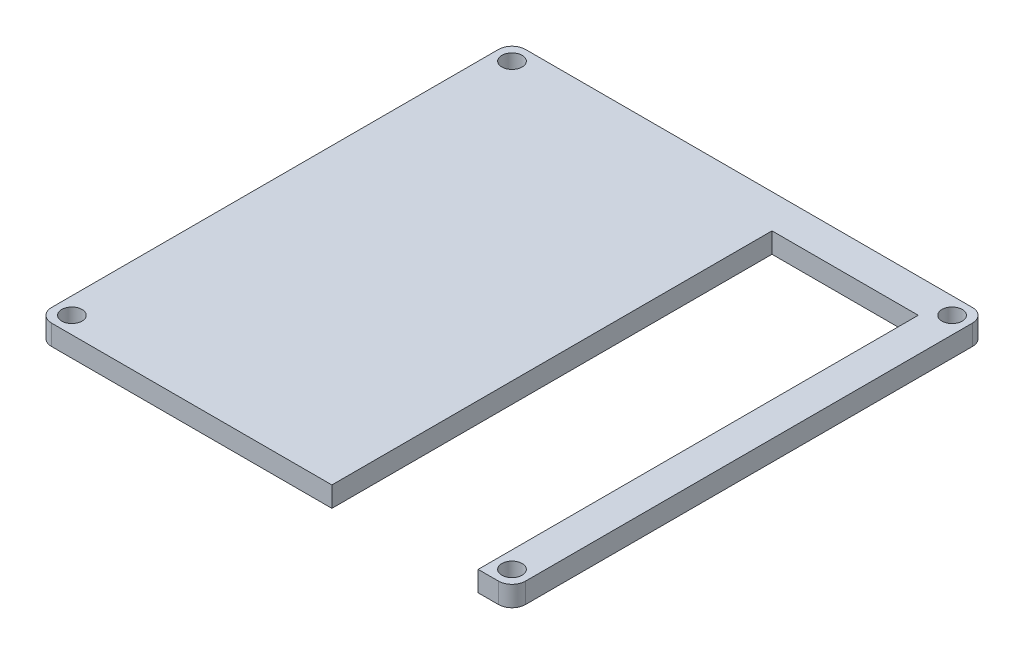
ISO-10303-21;
HEADER;
FILE_DESCRIPTION(('STEP AP214'),'2;1');
FILE_NAME('part.step','',(''),(''),'','','');
FILE_SCHEMA(('AUTOMOTIVE_DESIGN { 1 0 10303 214 1 1 1 1 }'));
ENDSEC;
DATA;
#1=APPLICATION_CONTEXT('core data for automotive mechanical design processes');
#2=APPLICATION_PROTOCOL_DEFINITION('international standard','automotive_design',2000,#1);
#3=PRODUCT_CONTEXT('',#1,'mechanical');
#4=PRODUCT('Part','Part','',(#3));
#5=PRODUCT_RELATED_PRODUCT_CATEGORY('part','',(#4));
#6=PRODUCT_DEFINITION_FORMATION('','',#4);
#7=PRODUCT_DEFINITION_CONTEXT('part definition',#1,'design');
#8=PRODUCT_DEFINITION('design','',#6,#7);
#9=PRODUCT_DEFINITION_SHAPE('','',#8);
#10=(LENGTH_UNIT() NAMED_UNIT(*) SI_UNIT(.MILLI.,.METRE.));
#11=(NAMED_UNIT(*) PLANE_ANGLE_UNIT() SI_UNIT($,.RADIAN.));
#12=(NAMED_UNIT(*) SI_UNIT($,.STERADIAN.) SOLID_ANGLE_UNIT());
#13=UNCERTAINTY_MEASURE_WITH_UNIT(LENGTH_MEASURE(1.E-05),#10,'distance_accuracy_value','');
#14=(GEOMETRIC_REPRESENTATION_CONTEXT(3) GLOBAL_UNCERTAINTY_ASSIGNED_CONTEXT((#13)) GLOBAL_UNIT_ASSIGNED_CONTEXT((#10,
#11,#12)) REPRESENTATION_CONTEXT('',''));
#15=CARTESIAN_POINT('',(0.,0.,0.));
#16=DIRECTION('',(0.,0.,1.));
#17=DIRECTION('',(1.,0.,0.));
#18=AXIS2_PLACEMENT_3D('',#15,#16,#17);
#19=CARTESIAN_POINT('',(-35.,3.,35.));
#20=DIRECTION('',(0.,0.,-1.));
#21=DIRECTION('',(-1.,0.,0.));
#22=AXIS2_PLACEMENT_3D('',#19,#20,#21);
#23=PLANE('',#22);
#24=DIRECTION('',(1.,0.,0.));
#25=VECTOR('',#24,1.);
#26=CARTESIAN_POINT('',(-35.,3.,35.));
#27=LINE('',#26,#25);
#28=CARTESIAN_POINT('',(30.,3.,35.));
#29=VERTEX_POINT('',#28);
#30=CARTESIAN_POINT('',(33.,3.,35.));
#31=VERTEX_POINT('',#30);
#32=EDGE_CURVE('E56',#29,#31,#27,.T.);
#33=ORIENTED_EDGE('',*,*,#32,.F.);
#34=DIRECTION('',(0.,-1.,0.));
#35=VECTOR('',#34,1.);
#36=CARTESIAN_POINT('',(30.,3.,35.));
#37=LINE('',#36,#35);
#38=CARTESIAN_POINT('',(30.,0.,35.));
#39=VERTEX_POINT('',#38);
#40=EDGE_CURVE('E41',#29,#39,#37,.T.);
#41=ORIENTED_EDGE('',*,*,#40,.T.);
#42=DIRECTION('',(1.,0.,0.));
#43=VECTOR('',#42,1.);
#44=CARTESIAN_POINT('',(-35.,0.,35.));
#45=LINE('',#44,#43);
#46=CARTESIAN_POINT('',(33.,0.,35.));
#47=VERTEX_POINT('',#46);
#48=EDGE_CURVE('E195',#39,#47,#45,.T.);
#49=ORIENTED_EDGE('',*,*,#48,.T.);
#50=DIRECTION('',(0.,-1.,0.));
#51=VECTOR('',#50,1.);
#52=CARTESIAN_POINT('',(33.,3.,35.));
#53=LINE('',#52,#51);
#54=EDGE_CURVE('E232',#47,#31,#53,.F.);
#55=ORIENTED_EDGE('',*,*,#54,.T.);
#56=EDGE_LOOP('',(#33,#41,#49,#55));
#57=FACE_BOUND('',#56,.T.);
#58=ADVANCED_FACE('F33',(#57),#23,.F.);
#59=CARTESIAN_POINT('',(0.,3.,0.));
#60=DIRECTION('',(0.,1.,0.));
#61=DIRECTION('',(0.,0.,1.));
#62=AXIS2_PLACEMENT_3D('',#59,#60,#61);
#63=PLANE('',#62);
#64=DIRECTION('',(0.,0.,-1.));
#65=VECTOR('',#64,1.);
#66=CARTESIAN_POINT('',(30.,3.,40.));
#67=LINE('',#66,#65);
#68=CARTESIAN_POINT('',(30.,3.,-30.));
#69=VERTEX_POINT('',#68);
#70=EDGE_CURVE('E133',#29,#69,#67,.T.);
#71=ORIENTED_EDGE('',*,*,#70,.F.);
#72=ORIENTED_EDGE('',*,*,#32,.T.);
#73=CARTESIAN_POINT('',(33.,3.,33.));
#74=DIRECTION('',(0.,1.,0.));
#75=DIRECTION('',(0.,0.,1.));
#76=AXIS2_PLACEMENT_3D('',#73,#74,#75);
#77=CIRCLE('',#76,2.);
#78=CARTESIAN_POINT('',(35.,3.,33.));
#79=VERTEX_POINT('',#78);
#80=EDGE_CURVE('E218',#31,#79,#77,.T.);
#81=ORIENTED_EDGE('',*,*,#80,.T.);
#82=DIRECTION('',(0.,0.,-1.));
#83=VECTOR('',#82,1.);
#84=CARTESIAN_POINT('',(35.,3.,-35.));
#85=LINE('',#84,#83);
#86=CARTESIAN_POINT('',(35.,3.,-33.));
#87=VERTEX_POINT('',#86);
#88=EDGE_CURVE('E174',#79,#87,#85,.T.);
#89=ORIENTED_EDGE('',*,*,#88,.T.);
#90=CARTESIAN_POINT('',(33.,3.,-33.));
#91=DIRECTION('',(0.,1.,0.));
#92=DIRECTION('',(0.,0.,1.));
#93=AXIS2_PLACEMENT_3D('',#90,#91,#92);
#94=CIRCLE('',#93,2.);
#95=CARTESIAN_POINT('',(33.,3.,-35.));
#96=VERTEX_POINT('',#95);
#97=EDGE_CURVE('E220',#87,#96,#94,.T.);
#98=ORIENTED_EDGE('',*,*,#97,.T.);
#99=DIRECTION('',(-1.,0.,0.));
#100=VECTOR('',#99,1.);
#101=CARTESIAN_POINT('',(-35.,3.,-35.));
#102=LINE('',#101,#100);
#103=CARTESIAN_POINT('',(-33.,3.,-35.));
#104=VERTEX_POINT('',#103);
#105=EDGE_CURVE('E177',#96,#104,#102,.T.);
#106=ORIENTED_EDGE('',*,*,#105,.T.);
#107=CARTESIAN_POINT('',(-33.,3.,-33.));
#108=DIRECTION('',(0.,1.,0.));
#109=DIRECTION('',(0.,0.,1.));
#110=AXIS2_PLACEMENT_3D('',#107,#108,#109);
#111=CIRCLE('',#110,2.);
#112=CARTESIAN_POINT('',(-35.,3.,-33.));
#113=VERTEX_POINT('',#112);
#114=EDGE_CURVE('E222',#104,#113,#111,.T.);
#115=ORIENTED_EDGE('',*,*,#114,.T.);
#116=DIRECTION('',(0.,0.,1.));
#117=VECTOR('',#116,1.);
#118=CARTESIAN_POINT('',(-35.,3.,-35.));
#119=LINE('',#118,#117);
#120=CARTESIAN_POINT('',(-35.,3.,33.));
#121=VERTEX_POINT('',#120);
#122=EDGE_CURVE('E181',#113,#121,#119,.T.);
#123=ORIENTED_EDGE('',*,*,#122,.T.);
#124=CARTESIAN_POINT('',(-33.,3.,33.));
#125=DIRECTION('',(0.,1.,0.));
#126=DIRECTION('',(0.,0.,1.));
#127=AXIS2_PLACEMENT_3D('',#124,#125,#126);
#128=CIRCLE('',#127,2.);
#129=CARTESIAN_POINT('',(-33.,3.,35.));
#130=VERTEX_POINT('',#129);
#131=EDGE_CURVE('E216',#121,#130,#128,.T.);
#132=ORIENTED_EDGE('',*,*,#131,.T.);
#133=CARTESIAN_POINT('',(8.4,3.,35.));
#134=VERTEX_POINT('',#133);
#135=EDGE_CURVE('E184',#130,#134,#27,.T.);
#136=ORIENTED_EDGE('',*,*,#135,.T.);
#137=DIRECTION('',(0.,0.,1.));
#138=VECTOR('',#137,1.);
#139=CARTESIAN_POINT('',(8.4,3.,40.));
#140=LINE('',#139,#138);
#141=CARTESIAN_POINT('',(8.4,3.,-30.));
#142=VERTEX_POINT('',#141);
#143=EDGE_CURVE('E48',#142,#134,#140,.T.);
#144=ORIENTED_EDGE('',*,*,#143,.F.);
#145=DIRECTION('',(-1.,0.,0.));
#146=VECTOR('',#145,1.);
#147=CARTESIAN_POINT('',(8.4,3.,-30.));
#148=LINE('',#147,#146);
#149=EDGE_CURVE('E128',#69,#142,#148,.T.);
#150=ORIENTED_EDGE('',*,*,#149,.F.);
#151=EDGE_LOOP('',(#71,#72,#81,#89,#98,#106,#115,#123,#132,#136,#144,#150));
#152=FACE_BOUND('',#151,.T.);
#153=CARTESIAN_POINT('',(32.5000000000007,3.,32.5));
#154=DIRECTION('',(0.,1.,0.));
#155=DIRECTION('',(0.,0.,1.));
#156=AXIS2_PLACEMENT_3D('',#153,#154,#155);
#157=CIRCLE('',#156,1.5);
#158=CARTESIAN_POINT('',(32.5000000000007,3.,34.));
#159=VERTEX_POINT('',#158);
#160=EDGE_CURVE('E156',#159,#159,#157,.T.);
#161=ORIENTED_EDGE('',*,*,#160,.F.);
#162=EDGE_LOOP('',(#161));
#163=FACE_BOUND('',#162,.T.);
#164=CARTESIAN_POINT('',(-32.5,3.,-32.5));
#165=DIRECTION('',(0.,1.,0.));
#166=DIRECTION('',(0.,0.,1.));
#167=AXIS2_PLACEMENT_3D('',#164,#165,#166);
#168=CIRCLE('',#167,1.5);
#169=CARTESIAN_POINT('',(-32.5,3.,-31.));
#170=VERTEX_POINT('',#169);
#171=EDGE_CURVE('E168',#170,#170,#168,.T.);
#172=ORIENTED_EDGE('',*,*,#171,.F.);
#173=EDGE_LOOP('',(#172));
#174=FACE_BOUND('',#173,.T.);
#175=CARTESIAN_POINT('',(32.5,3.,-32.5));
#176=DIRECTION('',(0.,1.,0.));
#177=DIRECTION('',(0.,0.,1.));
#178=AXIS2_PLACEMENT_3D('',#175,#176,#177);
#179=CIRCLE('',#178,1.5);
#180=CARTESIAN_POINT('',(32.5,3.,-31.));
#181=VERTEX_POINT('',#180);
#182=EDGE_CURVE('E162',#181,#181,#179,.T.);
#183=ORIENTED_EDGE('',*,*,#182,.F.);
#184=EDGE_LOOP('',(#183));
#185=FACE_BOUND('',#184,.T.);
#186=CARTESIAN_POINT('',(-32.4999999999993,3.,32.5));
#187=DIRECTION('',(0.,1.,0.));
#188=DIRECTION('',(0.,0.,1.));
#189=AXIS2_PLACEMENT_3D('',#186,#187,#188);
#190=CIRCLE('',#189,1.5);
#191=CARTESIAN_POINT('',(-32.4999999999993,3.,34.));
#192=VERTEX_POINT('',#191);
#193=EDGE_CURVE('E150',#192,#192,#190,.T.);
#194=ORIENTED_EDGE('',*,*,#193,.F.);
#195=EDGE_LOOP('',(#194));
#196=FACE_BOUND('',#195,.T.);
#197=ADVANCED_FACE('F137',(#152,#163,#174,#185,#196),#63,.T.);
#198=CARTESIAN_POINT('',(0.,0.,0.));
#199=DIRECTION('',(0.,1.,0.));
#200=DIRECTION('',(0.,0.,1.));
#201=AXIS2_PLACEMENT_3D('',#198,#199,#200);
#202=PLANE('',#201);
#203=ORIENTED_EDGE('',*,*,#48,.F.);
#204=DIRECTION('',(0.,0.,-1.));
#205=VECTOR('',#204,1.);
#206=CARTESIAN_POINT('',(30.,0.,0.));
#207=LINE('',#206,#205);
#208=CARTESIAN_POINT('',(30.,0.,-30.));
#209=VERTEX_POINT('',#208);
#210=EDGE_CURVE('E147',#39,#209,#207,.T.);
#211=ORIENTED_EDGE('',*,*,#210,.T.);
#212=DIRECTION('',(-1.,0.,0.));
#213=VECTOR('',#212,1.);
#214=CARTESIAN_POINT('',(0.,0.,-30.));
#215=LINE('',#214,#213);
#216=CARTESIAN_POINT('',(8.4,0.,-30.));
#217=VERTEX_POINT('',#216);
#218=EDGE_CURVE('E11',#209,#217,#215,.T.);
#219=ORIENTED_EDGE('',*,*,#218,.T.);
#220=DIRECTION('',(0.,0.,1.));
#221=VECTOR('',#220,1.);
#222=CARTESIAN_POINT('',(8.4,0.,0.));
#223=LINE('',#222,#221);
#224=CARTESIAN_POINT('',(8.4,0.,35.));
#225=VERTEX_POINT('',#224);
#226=EDGE_CURVE('E143',#217,#225,#223,.T.);
#227=ORIENTED_EDGE('',*,*,#226,.T.);
#228=CARTESIAN_POINT('',(-33.,0.,35.));
#229=VERTEX_POINT('',#228);
#230=EDGE_CURVE('E178',#229,#225,#45,.T.);
#231=ORIENTED_EDGE('',*,*,#230,.F.);
#232=CARTESIAN_POINT('',(-33.,0.,33.));
#233=DIRECTION('',(0.,1.,0.));
#234=DIRECTION('',(0.,0.,1.));
#235=AXIS2_PLACEMENT_3D('',#232,#233,#234);
#236=CIRCLE('',#235,2.);
#237=CARTESIAN_POINT('',(-35.,0.,33.));
#238=VERTEX_POINT('',#237);
#239=EDGE_CURVE('E202',#229,#238,#236,.F.);
#240=ORIENTED_EDGE('',*,*,#239,.T.);
#241=DIRECTION('',(0.,0.,1.));
#242=VECTOR('',#241,1.);
#243=CARTESIAN_POINT('',(-35.,0.,-35.));
#244=LINE('',#243,#242);
#245=CARTESIAN_POINT('',(-35.,0.,-33.));
#246=VERTEX_POINT('',#245);
#247=EDGE_CURVE('E192',#246,#238,#244,.T.);
#248=ORIENTED_EDGE('',*,*,#247,.F.);
#249=CARTESIAN_POINT('',(-33.,0.,-33.));
#250=DIRECTION('',(0.,1.,0.));
#251=DIRECTION('',(0.,0.,1.));
#252=AXIS2_PLACEMENT_3D('',#249,#250,#251);
#253=CIRCLE('',#252,2.);
#254=CARTESIAN_POINT('',(-33.,0.,-35.));
#255=VERTEX_POINT('',#254);
#256=EDGE_CURVE('E209',#246,#255,#253,.F.);
#257=ORIENTED_EDGE('',*,*,#256,.T.);
#258=DIRECTION('',(-1.,0.,0.));
#259=VECTOR('',#258,1.);
#260=CARTESIAN_POINT('',(-35.,0.,-35.));
#261=LINE('',#260,#259);
#262=CARTESIAN_POINT('',(33.,0.,-35.));
#263=VERTEX_POINT('',#262);
#264=EDGE_CURVE('E189',#263,#255,#261,.T.);
#265=ORIENTED_EDGE('',*,*,#264,.F.);
#266=CARTESIAN_POINT('',(33.,0.,-33.));
#267=DIRECTION('',(0.,1.,0.));
#268=DIRECTION('',(0.,0.,1.));
#269=AXIS2_PLACEMENT_3D('',#266,#267,#268);
#270=CIRCLE('',#269,2.);
#271=CARTESIAN_POINT('',(35.,0.,-33.));
#272=VERTEX_POINT('',#271);
#273=EDGE_CURVE('E207',#263,#272,#270,.F.);
#274=ORIENTED_EDGE('',*,*,#273,.T.);
#275=DIRECTION('',(0.,0.,-1.));
#276=VECTOR('',#275,1.);
#277=CARTESIAN_POINT('',(35.,0.,-35.));
#278=LINE('',#277,#276);
#279=CARTESIAN_POINT('',(35.,0.,33.));
#280=VERTEX_POINT('',#279);
#281=EDGE_CURVE('E171',#280,#272,#278,.T.);
#282=ORIENTED_EDGE('',*,*,#281,.F.);
#283=CARTESIAN_POINT('',(33.,0.,33.));
#284=DIRECTION('',(0.,1.,0.));
#285=DIRECTION('',(0.,0.,1.));
#286=AXIS2_PLACEMENT_3D('',#283,#284,#285);
#287=CIRCLE('',#286,2.);
#288=EDGE_CURVE('E204',#280,#47,#287,.F.);
#289=ORIENTED_EDGE('',*,*,#288,.T.);
#290=EDGE_LOOP('',(#203,#211,#219,#227,#231,#240,#248,#257,#265,#274,#282,#289));
#291=FACE_BOUND('',#290,.T.);
#292=CARTESIAN_POINT('',(-32.5,0.,-32.5));
#293=DIRECTION('',(0.,1.,0.));
#294=DIRECTION('',(0.,0.,1.));
#295=AXIS2_PLACEMENT_3D('',#292,#293,#294);
#296=CIRCLE('',#295,1.5);
#297=CARTESIAN_POINT('',(-32.5,0.,-31.));
#298=VERTEX_POINT('',#297);
#299=EDGE_CURVE('E165',#298,#298,#296,.T.);
#300=ORIENTED_EDGE('',*,*,#299,.T.);
#301=EDGE_LOOP('',(#300));
#302=FACE_BOUND('',#301,.T.);
#303=CARTESIAN_POINT('',(32.5,0.,-32.5));
#304=DIRECTION('',(0.,1.,0.));
#305=DIRECTION('',(0.,0.,1.));
#306=AXIS2_PLACEMENT_3D('',#303,#304,#305);
#307=CIRCLE('',#306,1.5);
#308=CARTESIAN_POINT('',(32.5,0.,-31.));
#309=VERTEX_POINT('',#308);
#310=EDGE_CURVE('E159',#309,#309,#307,.T.);
#311=ORIENTED_EDGE('',*,*,#310,.T.);
#312=EDGE_LOOP('',(#311));
#313=FACE_BOUND('',#312,.T.);
#314=CARTESIAN_POINT('',(32.5000000000007,0.,32.5));
#315=DIRECTION('',(0.,1.,0.));
#316=DIRECTION('',(0.,0.,1.));
#317=AXIS2_PLACEMENT_3D('',#314,#315,#316);
#318=CIRCLE('',#317,1.5);
#319=CARTESIAN_POINT('',(32.5000000000007,0.,34.));
#320=VERTEX_POINT('',#319);
#321=EDGE_CURVE('E153',#320,#320,#318,.T.);
#322=ORIENTED_EDGE('',*,*,#321,.T.);
#323=EDGE_LOOP('',(#322));
#324=FACE_BOUND('',#323,.T.);
#325=CARTESIAN_POINT('',(-32.4999999999993,0.,32.5));
#326=DIRECTION('',(0.,1.,0.));
#327=DIRECTION('',(0.,0.,1.));
#328=AXIS2_PLACEMENT_3D('',#325,#326,#327);
#329=CIRCLE('',#328,1.5);
#330=CARTESIAN_POINT('',(-32.4999999999993,0.,34.));
#331=VERTEX_POINT('',#330);
#332=EDGE_CURVE('E149',#331,#331,#329,.T.);
#333=ORIENTED_EDGE('',*,*,#332,.T.);
#334=EDGE_LOOP('',(#333));
#335=FACE_BOUND('',#334,.T.);
#336=ADVANCED_FACE('F238',(#291,#302,#313,#324,#335),#202,.F.);
#337=CARTESIAN_POINT('',(35.,3.,-35.));
#338=DIRECTION('',(-1.,0.,0.));
#339=DIRECTION('',(0.,0.,1.));
#340=AXIS2_PLACEMENT_3D('',#337,#338,#339);
#341=PLANE('',#340);
#342=ORIENTED_EDGE('',*,*,#281,.T.);
#343=DIRECTION('',(0.,-1.,0.));
#344=VECTOR('',#343,1.);
#345=CARTESIAN_POINT('',(35.,3.,-33.));
#346=LINE('',#345,#344);
#347=EDGE_CURVE('E227',#272,#87,#346,.F.);
#348=ORIENTED_EDGE('',*,*,#347,.T.);
#349=ORIENTED_EDGE('',*,*,#88,.F.);
#350=DIRECTION('',(0.,-1.,0.));
#351=VECTOR('',#350,1.);
#352=CARTESIAN_POINT('',(35.,3.,33.));
#353=LINE('',#352,#351);
#354=EDGE_CURVE('E224',#79,#280,#353,.T.);
#355=ORIENTED_EDGE('',*,*,#354,.T.);
#356=EDGE_LOOP('',(#342,#348,#349,#355));
#357=FACE_BOUND('',#356,.T.);
#358=ADVANCED_FACE('F249',(#357),#341,.F.);
#359=CARTESIAN_POINT('',(-35.,3.,-35.));
#360=DIRECTION('',(0.,0.,1.));
#361=DIRECTION('',(1.,0.,0.));
#362=AXIS2_PLACEMENT_3D('',#359,#360,#361);
#363=PLANE('',#362);
#364=ORIENTED_EDGE('',*,*,#264,.T.);
#365=DIRECTION('',(0.,-1.,0.));
#366=VECTOR('',#365,1.);
#367=CARTESIAN_POINT('',(-33.,3.,-35.));
#368=LINE('',#367,#366);
#369=EDGE_CURVE('E214',#255,#104,#368,.F.);
#370=ORIENTED_EDGE('',*,*,#369,.T.);
#371=ORIENTED_EDGE('',*,*,#105,.F.);
#372=DIRECTION('',(0.,-1.,0.));
#373=VECTOR('',#372,1.);
#374=CARTESIAN_POINT('',(33.,3.,-35.));
#375=LINE('',#374,#373);
#376=EDGE_CURVE('E211',#96,#263,#375,.T.);
#377=ORIENTED_EDGE('',*,*,#376,.T.);
#378=EDGE_LOOP('',(#364,#370,#371,#377));
#379=FACE_BOUND('',#378,.T.);
#380=ADVANCED_FACE('F257',(#379),#363,.F.);
#381=CARTESIAN_POINT('',(-35.,3.,-35.));
#382=DIRECTION('',(1.,0.,0.));
#383=DIRECTION('',(0.,0.,-1.));
#384=AXIS2_PLACEMENT_3D('',#381,#382,#383);
#385=PLANE('',#384);
#386=ORIENTED_EDGE('',*,*,#122,.F.);
#387=DIRECTION('',(0.,-1.,0.));
#388=VECTOR('',#387,1.);
#389=CARTESIAN_POINT('',(-35.,3.,-33.));
#390=LINE('',#389,#388);
#391=EDGE_CURVE('E199',#113,#246,#390,.T.);
#392=ORIENTED_EDGE('',*,*,#391,.T.);
#393=ORIENTED_EDGE('',*,*,#247,.T.);
#394=DIRECTION('',(0.,-1.,0.));
#395=VECTOR('',#394,1.);
#396=CARTESIAN_POINT('',(-35.,3.,33.));
#397=LINE('',#396,#395);
#398=EDGE_CURVE('E186',#238,#121,#397,.F.);
#399=ORIENTED_EDGE('',*,*,#398,.T.);
#400=EDGE_LOOP('',(#386,#392,#393,#399));
#401=FACE_BOUND('',#400,.T.);
#402=ADVANCED_FACE('F266',(#401),#385,.F.);
#403=ORIENTED_EDGE('',*,*,#230,.T.);
#404=DIRECTION('',(0.,1.,0.));
#405=VECTOR('',#404,1.);
#406=CARTESIAN_POINT('',(8.4,3.,35.));
#407=LINE('',#406,#405);
#408=EDGE_CURVE('E234',#225,#134,#407,.T.);
#409=ORIENTED_EDGE('',*,*,#408,.T.);
#410=ORIENTED_EDGE('',*,*,#135,.F.);
#411=DIRECTION('',(0.,-1.,0.));
#412=VECTOR('',#411,1.);
#413=CARTESIAN_POINT('',(-33.,3.,35.));
#414=LINE('',#413,#412);
#415=EDGE_CURVE('E229',#130,#229,#414,.T.);
#416=ORIENTED_EDGE('',*,*,#415,.T.);
#417=EDGE_LOOP('',(#403,#409,#410,#416));
#418=FACE_BOUND('',#417,.T.);
#419=ADVANCED_FACE('F273',(#418),#23,.F.);
#420=CARTESIAN_POINT('',(-32.5,3.,-32.5));
#421=DIRECTION('',(0.,-1.,0.));
#422=DIRECTION('',(0.,0.,-1.));
#423=AXIS2_PLACEMENT_3D('',#420,#421,#422);
#424=CYLINDRICAL_SURFACE('',#423,1.5);
#425=ORIENTED_EDGE('',*,*,#171,.T.);
#426=EDGE_LOOP('',(#425));
#427=FACE_BOUND('',#426,.T.);
#428=ORIENTED_EDGE('',*,*,#299,.F.);
#429=EDGE_LOOP('',(#428));
#430=FACE_BOUND('',#429,.T.);
#431=ADVANCED_FACE('F293',(#427,#430),#424,.F.);
#432=CARTESIAN_POINT('',(32.5,3.,-32.5));
#433=DIRECTION('',(0.,-1.,0.));
#434=DIRECTION('',(0.,0.,-1.));
#435=AXIS2_PLACEMENT_3D('',#432,#433,#434);
#436=CYLINDRICAL_SURFACE('',#435,1.5);
#437=ORIENTED_EDGE('',*,*,#182,.T.);
#438=EDGE_LOOP('',(#437));
#439=FACE_BOUND('',#438,.T.);
#440=ORIENTED_EDGE('',*,*,#310,.F.);
#441=EDGE_LOOP('',(#440));
#442=FACE_BOUND('',#441,.T.);
#443=ADVANCED_FACE('F299',(#439,#442),#436,.F.);
#444=CARTESIAN_POINT('',(32.5000000000007,3.,32.5));
#445=DIRECTION('',(0.,-1.,0.));
#446=DIRECTION('',(0.,0.,-1.));
#447=AXIS2_PLACEMENT_3D('',#444,#445,#446);
#448=CYLINDRICAL_SURFACE('',#447,1.5);
#449=ORIENTED_EDGE('',*,*,#160,.T.);
#450=EDGE_LOOP('',(#449));
#451=FACE_BOUND('',#450,.T.);
#452=ORIENTED_EDGE('',*,*,#321,.F.);
#453=EDGE_LOOP('',(#452));
#454=FACE_BOUND('',#453,.T.);
#455=ADVANCED_FACE('F325',(#451,#454),#448,.F.);
#456=CARTESIAN_POINT('',(-32.4999999999993,3.,32.5));
#457=DIRECTION('',(0.,-1.,0.));
#458=DIRECTION('',(0.,0.,-1.));
#459=AXIS2_PLACEMENT_3D('',#456,#457,#458);
#460=CYLINDRICAL_SURFACE('',#459,1.5);
#461=ORIENTED_EDGE('',*,*,#193,.T.);
#462=EDGE_LOOP('',(#461));
#463=FACE_BOUND('',#462,.T.);
#464=ORIENTED_EDGE('',*,*,#332,.F.);
#465=EDGE_LOOP('',(#464));
#466=FACE_BOUND('',#465,.T.);
#467=ADVANCED_FACE('F312',(#463,#466),#460,.F.);
#468=CARTESIAN_POINT('',(-33.,3.,-33.));
#469=DIRECTION('',(0.,-1.,0.));
#470=DIRECTION('',(0.,0.,-1.));
#471=AXIS2_PLACEMENT_3D('',#468,#469,#470);
#472=CYLINDRICAL_SURFACE('',#471,2.);
#473=ORIENTED_EDGE('',*,*,#114,.F.);
#474=ORIENTED_EDGE('',*,*,#369,.F.);
#475=ORIENTED_EDGE('',*,*,#256,.F.);
#476=ORIENTED_EDGE('',*,*,#391,.F.);
#477=EDGE_LOOP('',(#473,#474,#475,#476));
#478=FACE_BOUND('',#477,.T.);
#479=ADVANCED_FACE('F261',(#478),#472,.T.);
#480=CARTESIAN_POINT('',(33.,3.,-33.));
#481=DIRECTION('',(0.,-1.,0.));
#482=DIRECTION('',(0.,0.,-1.));
#483=AXIS2_PLACEMENT_3D('',#480,#481,#482);
#484=CYLINDRICAL_SURFACE('',#483,2.);
#485=ORIENTED_EDGE('',*,*,#97,.F.);
#486=ORIENTED_EDGE('',*,*,#347,.F.);
#487=ORIENTED_EDGE('',*,*,#273,.F.);
#488=ORIENTED_EDGE('',*,*,#376,.F.);
#489=EDGE_LOOP('',(#485,#486,#487,#488));
#490=FACE_BOUND('',#489,.T.);
#491=ADVANCED_FACE('F252',(#490),#484,.T.);
#492=CARTESIAN_POINT('',(33.,3.,33.));
#493=DIRECTION('',(0.,-1.,0.));
#494=DIRECTION('',(0.,0.,-1.));
#495=AXIS2_PLACEMENT_3D('',#492,#493,#494);
#496=CYLINDRICAL_SURFACE('',#495,2.);
#497=ORIENTED_EDGE('',*,*,#80,.F.);
#498=ORIENTED_EDGE('',*,*,#54,.F.);
#499=ORIENTED_EDGE('',*,*,#288,.F.);
#500=ORIENTED_EDGE('',*,*,#354,.F.);
#501=EDGE_LOOP('',(#497,#498,#499,#500));
#502=FACE_BOUND('',#501,.T.);
#503=ADVANCED_FACE('F245',(#502),#496,.T.);
#504=CARTESIAN_POINT('',(-33.,3.,33.));
#505=DIRECTION('',(0.,-1.,0.));
#506=DIRECTION('',(0.,0.,-1.));
#507=AXIS2_PLACEMENT_3D('',#504,#505,#506);
#508=CYLINDRICAL_SURFACE('',#507,2.);
#509=ORIENTED_EDGE('',*,*,#131,.F.);
#510=ORIENTED_EDGE('',*,*,#398,.F.);
#511=ORIENTED_EDGE('',*,*,#239,.F.);
#512=ORIENTED_EDGE('',*,*,#415,.F.);
#513=EDGE_LOOP('',(#509,#510,#511,#512));
#514=FACE_BOUND('',#513,.T.);
#515=ADVANCED_FACE('F35',(#514),#508,.T.);
#516=CARTESIAN_POINT('',(8.4,-7.,-30.));
#517=DIRECTION('',(0.,0.,-1.));
#518=DIRECTION('',(-1.,0.,0.));
#519=AXIS2_PLACEMENT_3D('',#516,#517,#518);
#520=PLANE('',#519);
#521=DIRECTION('',(0.,1.,0.));
#522=VECTOR('',#521,1.);
#523=CARTESIAN_POINT('',(30.,-7.,-30.));
#524=LINE('',#523,#522);
#525=EDGE_CURVE('E123',#209,#69,#524,.T.);
#526=ORIENTED_EDGE('',*,*,#525,.T.);
#527=ORIENTED_EDGE('',*,*,#149,.T.);
#528=DIRECTION('',(0.,1.,0.));
#529=VECTOR('',#528,1.);
#530=CARTESIAN_POINT('',(8.4,-7.,-30.));
#531=LINE('',#530,#529);
#532=EDGE_CURVE('E131',#217,#142,#531,.T.);
#533=ORIENTED_EDGE('',*,*,#532,.F.);
#534=ORIENTED_EDGE('',*,*,#218,.F.);
#535=EDGE_LOOP('',(#526,#527,#533,#534));
#536=FACE_BOUND('',#535,.T.);
#537=ADVANCED_FACE('F125',(#536),#520,.F.);
#538=CARTESIAN_POINT('',(30.,-7.,40.));
#539=DIRECTION('',(1.,0.,0.));
#540=DIRECTION('',(0.,0.,-1.));
#541=AXIS2_PLACEMENT_3D('',#538,#539,#540);
#542=PLANE('',#541);
#543=ORIENTED_EDGE('',*,*,#40,.F.);
#544=ORIENTED_EDGE('',*,*,#70,.T.);
#545=ORIENTED_EDGE('',*,*,#525,.F.);
#546=ORIENTED_EDGE('',*,*,#210,.F.);
#547=EDGE_LOOP('',(#543,#544,#545,#546));
#548=FACE_BOUND('',#547,.T.);
#549=ADVANCED_FACE('F134',(#548),#542,.F.);
#550=CARTESIAN_POINT('',(8.4,-7.,40.));
#551=DIRECTION('',(-1.,0.,0.));
#552=DIRECTION('',(0.,0.,1.));
#553=AXIS2_PLACEMENT_3D('',#550,#551,#552);
#554=PLANE('',#553);
#555=ORIENTED_EDGE('',*,*,#532,.T.);
#556=ORIENTED_EDGE('',*,*,#143,.T.);
#557=ORIENTED_EDGE('',*,*,#408,.F.);
#558=ORIENTED_EDGE('',*,*,#226,.F.);
#559=EDGE_LOOP('',(#555,#556,#557,#558));
#560=FACE_BOUND('',#559,.T.);
#561=ADVANCED_FACE('F275',(#560),#554,.F.);
#562=CLOSED_SHELL('',(#58,#197,#336,#358,#380,#402,#419,#431,#443,#455,#467,#479,#491,#503,#515,
#537,#549,#561));
#563=MANIFOLD_SOLID_BREP('B2',#562);
#564=ADVANCED_BREP_SHAPE_REPRESENTATION('',(#18,#563),#14);
#565=SHAPE_DEFINITION_REPRESENTATION(#9,#564);
ENDSEC;
END-ISO-10303-21;
